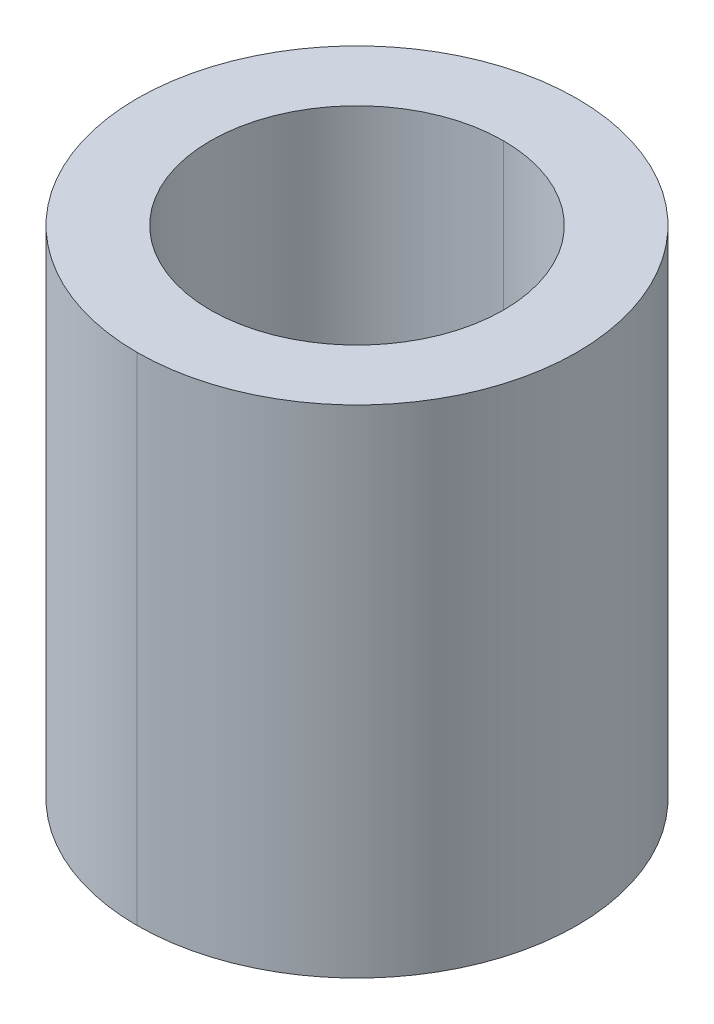
ISO-10303-21;
HEADER;
FILE_DESCRIPTION(('STEP AP214'),'2;1');
FILE_NAME('part.step','',(''),(''),'','','');
FILE_SCHEMA(('AUTOMOTIVE_DESIGN { 1 0 10303 214 1 1 1 1 }'));
ENDSEC;
DATA;
#1=APPLICATION_CONTEXT('core data for automotive mechanical design processes');
#2=APPLICATION_PROTOCOL_DEFINITION('international standard','automotive_design',2000,#1);
#3=PRODUCT_CONTEXT('',#1,'mechanical');
#4=PRODUCT('Part','Part','',(#3));
#5=PRODUCT_RELATED_PRODUCT_CATEGORY('part','',(#4));
#6=PRODUCT_DEFINITION_FORMATION('','',#4);
#7=PRODUCT_DEFINITION_CONTEXT('part definition',#1,'design');
#8=PRODUCT_DEFINITION('design','',#6,#7);
#9=PRODUCT_DEFINITION_SHAPE('','',#8);
#10=(LENGTH_UNIT() NAMED_UNIT(*) SI_UNIT(.MILLI.,.METRE.));
#11=(NAMED_UNIT(*) PLANE_ANGLE_UNIT() SI_UNIT($,.RADIAN.));
#12=(NAMED_UNIT(*) SI_UNIT($,.STERADIAN.) SOLID_ANGLE_UNIT());
#13=UNCERTAINTY_MEASURE_WITH_UNIT(LENGTH_MEASURE(1.E-05),#10,'distance_accuracy_value','');
#14=(GEOMETRIC_REPRESENTATION_CONTEXT(3) GLOBAL_UNCERTAINTY_ASSIGNED_CONTEXT((#13)) GLOBAL_UNIT_ASSIGNED_CONTEXT((#10,
#11,#12)) REPRESENTATION_CONTEXT('',''));
#15=CARTESIAN_POINT('',(0.,0.,0.));
#16=DIRECTION('',(0.,0.,1.));
#17=DIRECTION('',(1.,0.,0.));
#18=AXIS2_PLACEMENT_3D('',#15,#16,#17);
#19=CARTESIAN_POINT('',(0.,86.,0.));
#20=DIRECTION('',(0.,-1.,0.));
#21=DIRECTION('',(0.,0.,-1.));
#22=AXIS2_PLACEMENT_3D('',#19,#20,#21);
#23=CYLINDRICAL_SURFACE('',#22,25.4);
#24=DIRECTION('',(0.,-1.,0.));
#25=VECTOR('',#24,1.);
#26=CARTESIAN_POINT('',(0.,86.,25.4));
#27=LINE('',#26,#25);
#28=CARTESIAN_POINT('',(0.,86.,25.4));
#29=VERTEX_POINT('',#28);
#30=CARTESIAN_POINT('',(0.,0.,25.4));
#31=VERTEX_POINT('',#30);
#32=EDGE_CURVE('E102',#29,#31,#27,.T.);
#33=ORIENTED_EDGE('',*,*,#32,.F.);
#34=CARTESIAN_POINT('',(0.,86.,0.));
#35=DIRECTION('',(0.,1.,0.));
#36=DIRECTION('',(0.,0.,1.));
#37=AXIS2_PLACEMENT_3D('',#34,#35,#36);
#38=CIRCLE('',#37,25.4);
#39=CARTESIAN_POINT('',(0.,86.,-25.4));
#40=VERTEX_POINT('',#39);
#41=EDGE_CURVE('E76',#29,#40,#38,.T.);
#42=ORIENTED_EDGE('',*,*,#41,.T.);
#43=DIRECTION('',(0.,-1.,0.));
#44=VECTOR('',#43,1.);
#45=CARTESIAN_POINT('',(0.,86.,-25.4));
#46=LINE('',#45,#44);
#47=CARTESIAN_POINT('',(0.,0.,-25.4));
#48=VERTEX_POINT('',#47);
#49=EDGE_CURVE('E20',#40,#48,#46,.T.);
#50=ORIENTED_EDGE('',*,*,#49,.T.);
#51=CARTESIAN_POINT('',(0.,0.,0.));
#52=DIRECTION('',(0.,1.,0.));
#53=DIRECTION('',(0.,0.,1.));
#54=AXIS2_PLACEMENT_3D('',#51,#52,#53);
#55=CIRCLE('',#54,25.4);
#56=EDGE_CURVE('E11',#31,#48,#55,.T.);
#57=ORIENTED_EDGE('',*,*,#56,.F.);
#58=EDGE_LOOP('',(#33,#42,#50,#57));
#59=FACE_BOUND('',#58,.T.);
#60=ADVANCED_FACE('F17',(#59),#23,.F.);
#61=CARTESIAN_POINT('',(0.,86.,0.));
#62=DIRECTION('',(0.,-1.,0.));
#63=DIRECTION('',(0.,0.,-1.));
#64=AXIS2_PLACEMENT_3D('',#61,#62,#63);
#65=CYLINDRICAL_SURFACE('',#64,38.1);
#66=DIRECTION('',(0.,-1.,0.));
#67=VECTOR('',#66,1.);
#68=CARTESIAN_POINT('',(0.,86.,38.1));
#69=LINE('',#68,#67);
#70=CARTESIAN_POINT('',(0.,86.,38.1));
#71=VERTEX_POINT('',#70);
#72=CARTESIAN_POINT('',(0.,0.,38.1));
#73=VERTEX_POINT('',#72);
#74=EDGE_CURVE('E80',#71,#73,#69,.T.);
#75=ORIENTED_EDGE('',*,*,#74,.F.);
#76=CARTESIAN_POINT('',(0.,86.,0.));
#77=DIRECTION('',(0.,1.,0.));
#78=DIRECTION('',(0.,0.,1.));
#79=AXIS2_PLACEMENT_3D('',#76,#77,#78);
#80=CIRCLE('',#79,38.1);
#81=CARTESIAN_POINT('',(0.,86.,-38.1));
#82=VERTEX_POINT('',#81);
#83=EDGE_CURVE('E70',#82,#71,#80,.T.);
#84=ORIENTED_EDGE('',*,*,#83,.F.);
#85=DIRECTION('',(0.,-1.,0.));
#86=VECTOR('',#85,1.);
#87=CARTESIAN_POINT('',(0.,86.,-38.1));
#88=LINE('',#87,#86);
#89=CARTESIAN_POINT('',(0.,0.,-38.1));
#90=VERTEX_POINT('',#89);
#91=EDGE_CURVE('E77',#82,#90,#88,.T.);
#92=ORIENTED_EDGE('',*,*,#91,.T.);
#93=CARTESIAN_POINT('',(0.,0.,0.));
#94=DIRECTION('',(0.,1.,0.));
#95=DIRECTION('',(0.,0.,1.));
#96=AXIS2_PLACEMENT_3D('',#93,#94,#95);
#97=CIRCLE('',#96,38.1);
#98=EDGE_CURVE('E26',#90,#73,#97,.T.);
#99=ORIENTED_EDGE('',*,*,#98,.T.);
#100=EDGE_LOOP('',(#75,#84,#92,#99));
#101=FACE_BOUND('',#100,.T.);
#102=ADVANCED_FACE('F81',(#101),#65,.T.);
#103=CARTESIAN_POINT('',(0.,0.,0.));
#104=DIRECTION('',(0.,1.,0.));
#105=DIRECTION('',(1.,0.,0.));
#106=AXIS2_PLACEMENT_3D('',#103,#104,#105);
#107=PLANE('',#106);
#108=CARTESIAN_POINT('',(0.,0.,0.));
#109=DIRECTION('',(0.,1.,0.));
#110=DIRECTION('',(0.,0.,1.));
#111=AXIS2_PLACEMENT_3D('',#108,#109,#110);
#112=CIRCLE('',#111,25.4);
#113=EDGE_CURVE('E96',#48,#31,#112,.T.);
#114=ORIENTED_EDGE('',*,*,#113,.T.);
#115=ORIENTED_EDGE('',*,*,#56,.T.);
#116=EDGE_LOOP('',(#114,#115));
#117=FACE_BOUND('',#116,.T.);
#118=ORIENTED_EDGE('',*,*,#98,.F.);
#119=CARTESIAN_POINT('',(0.,0.,0.));
#120=DIRECTION('',(0.,1.,0.));
#121=DIRECTION('',(0.,0.,1.));
#122=AXIS2_PLACEMENT_3D('',#119,#120,#121);
#123=CIRCLE('',#122,38.1);
#124=EDGE_CURVE('E85',#73,#90,#123,.T.);
#125=ORIENTED_EDGE('',*,*,#124,.F.);
#126=EDGE_LOOP('',(#118,#125));
#127=FACE_BOUND('',#126,.T.);
#128=ADVANCED_FACE('F129',(#117,#127),#107,.F.);
#129=CARTESIAN_POINT('',(0.,86.,0.));
#130=DIRECTION('',(0.,1.,0.));
#131=DIRECTION('',(1.,0.,0.));
#132=AXIS2_PLACEMENT_3D('',#129,#130,#131);
#133=PLANE('',#132);
#134=CARTESIAN_POINT('',(0.,86.,0.));
#135=DIRECTION('',(0.,1.,0.));
#136=DIRECTION('',(0.,0.,1.));
#137=AXIS2_PLACEMENT_3D('',#134,#135,#136);
#138=CIRCLE('',#137,25.4);
#139=EDGE_CURVE('E100',#40,#29,#138,.T.);
#140=ORIENTED_EDGE('',*,*,#139,.F.);
#141=ORIENTED_EDGE('',*,*,#41,.F.);
#142=EDGE_LOOP('',(#140,#141));
#143=FACE_BOUND('',#142,.T.);
#144=ORIENTED_EDGE('',*,*,#83,.T.);
#145=CARTESIAN_POINT('',(0.,86.,0.));
#146=DIRECTION('',(0.,1.,0.));
#147=DIRECTION('',(0.,0.,1.));
#148=AXIS2_PLACEMENT_3D('',#145,#146,#147);
#149=CIRCLE('',#148,38.1);
#150=EDGE_CURVE('E73',#71,#82,#149,.T.);
#151=ORIENTED_EDGE('',*,*,#150,.T.);
#152=EDGE_LOOP('',(#144,#151));
#153=FACE_BOUND('',#152,.T.);
#154=ADVANCED_FACE('F71',(#143,#153),#133,.T.);
#155=CARTESIAN_POINT('',(0.,86.,0.));
#156=DIRECTION('',(0.,-1.,0.));
#157=DIRECTION('',(0.,0.,-1.));
#158=AXIS2_PLACEMENT_3D('',#155,#156,#157);
#159=CYLINDRICAL_SURFACE('',#158,38.1);
#160=ORIENTED_EDGE('',*,*,#150,.F.);
#161=ORIENTED_EDGE('',*,*,#74,.T.);
#162=ORIENTED_EDGE('',*,*,#124,.T.);
#163=ORIENTED_EDGE('',*,*,#91,.F.);
#164=EDGE_LOOP('',(#160,#161,#162,#163));
#165=FACE_BOUND('',#164,.T.);
#166=ADVANCED_FACE('F87',(#165),#159,.T.);
#167=CARTESIAN_POINT('',(0.,86.,0.));
#168=DIRECTION('',(0.,-1.,0.));
#169=DIRECTION('',(0.,0.,-1.));
#170=AXIS2_PLACEMENT_3D('',#167,#168,#169);
#171=CYLINDRICAL_SURFACE('',#170,25.4);
#172=ORIENTED_EDGE('',*,*,#139,.T.);
#173=ORIENTED_EDGE('',*,*,#32,.T.);
#174=ORIENTED_EDGE('',*,*,#113,.F.);
#175=ORIENTED_EDGE('',*,*,#49,.F.);
#176=EDGE_LOOP('',(#172,#173,#174,#175));
#177=FACE_BOUND('',#176,.T.);
#178=ADVANCED_FACE('F126',(#177),#171,.F.);
#179=CLOSED_SHELL('',(#60,#102,#128,#154,#166,#178));
#180=MANIFOLD_SOLID_BREP('B1',#179);
#181=ADVANCED_BREP_SHAPE_REPRESENTATION('',(#18,#180),#14);
#182=SHAPE_DEFINITION_REPRESENTATION(#9,#181);
ENDSEC;
END-ISO-10303-21;
